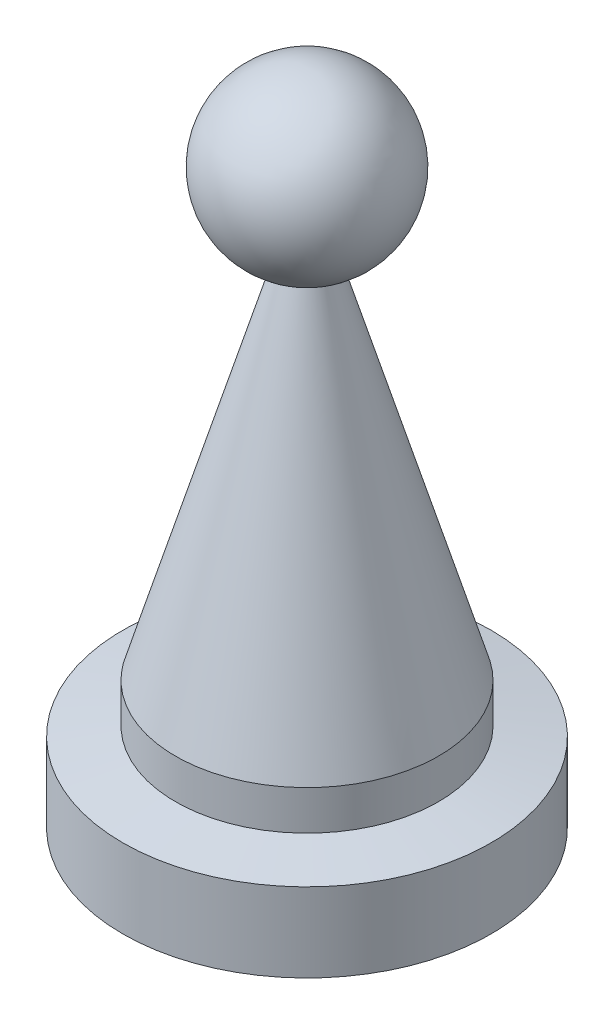
ISO-10303-21;
HEADER;
FILE_DESCRIPTION(('STEP AP214'),'2;1');
FILE_NAME('part.step','',(''),(''),'','','');
FILE_SCHEMA(('AUTOMOTIVE_DESIGN { 1 0 10303 214 1 1 1 1 }'));
ENDSEC;
DATA;
#1=APPLICATION_CONTEXT('core data for automotive mechanical design processes');
#2=APPLICATION_PROTOCOL_DEFINITION('international standard','automotive_design',2000,#1);
#3=PRODUCT_CONTEXT('',#1,'mechanical');
#4=PRODUCT('Part','Part','',(#3));
#5=PRODUCT_RELATED_PRODUCT_CATEGORY('part','',(#4));
#6=PRODUCT_DEFINITION_FORMATION('','',#4);
#7=PRODUCT_DEFINITION_CONTEXT('part definition',#1,'design');
#8=PRODUCT_DEFINITION('design','',#6,#7);
#9=PRODUCT_DEFINITION_SHAPE('','',#8);
#10=(LENGTH_UNIT() NAMED_UNIT(*) SI_UNIT(.MILLI.,.METRE.));
#11=(NAMED_UNIT(*) PLANE_ANGLE_UNIT() SI_UNIT($,.RADIAN.));
#12=(NAMED_UNIT(*) SI_UNIT($,.STERADIAN.) SOLID_ANGLE_UNIT());
#13=UNCERTAINTY_MEASURE_WITH_UNIT(LENGTH_MEASURE(1.E-05),#10,'distance_accuracy_value','');
#14=(GEOMETRIC_REPRESENTATION_CONTEXT(3) GLOBAL_UNCERTAINTY_ASSIGNED_CONTEXT((#13)) GLOBAL_UNIT_ASSIGNED_CONTEXT((#10,
#11,#12)) REPRESENTATION_CONTEXT('',''));
#15=CARTESIAN_POINT('',(0.,0.,0.));
#16=DIRECTION('',(0.,0.,1.));
#17=DIRECTION('',(1.,0.,0.));
#18=AXIS2_PLACEMENT_3D('',#15,#16,#17);
#19=CARTESIAN_POINT('',(0.,0.,0.));
#20=DIRECTION('',(0.,-1.,0.));
#21=DIRECTION('',(0.,0.,-1.));
#22=AXIS2_PLACEMENT_3D('',#19,#20,#21);
#23=PLANE('',#22);
#24=CARTESIAN_POINT('',(0.,0.,0.));
#25=DIRECTION('',(0.,-1.,0.));
#26=DIRECTION('',(0.,0.,-1.));
#27=AXIS2_PLACEMENT_3D('',#24,#25,#26);
#28=CIRCLE('',#27,7.);
#29=CARTESIAN_POINT('',(0.,0.,-7.));
#30=VERTEX_POINT('',#29);
#31=EDGE_CURVE('E10',#30,#30,#28,.T.);
#32=ORIENTED_EDGE('',*,*,#31,.T.);
#33=EDGE_LOOP('',(#32));
#34=FACE_BOUND('',#33,.T.);
#35=ADVANCED_FACE('F31',(#34),#23,.T.);
#36=CARTESIAN_POINT('',(0.,0.,0.));
#37=DIRECTION('',(0.,-1.,0.));
#38=DIRECTION('',(0.,0.,-1.));
#39=AXIS2_PLACEMENT_3D('',#36,#37,#38);
#40=CYLINDRICAL_SURFACE('',#39,7.);
#41=CARTESIAN_POINT('',(0.,3.,0.));
#42=DIRECTION('',(0.,-1.,0.));
#43=DIRECTION('',(0.,0.,-1.));
#44=AXIS2_PLACEMENT_3D('',#41,#42,#43);
#45=CIRCLE('',#44,7.);
#46=CARTESIAN_POINT('',(0.,3.,-7.));
#47=VERTEX_POINT('',#46);
#48=EDGE_CURVE('E37',#47,#47,#45,.T.);
#49=ORIENTED_EDGE('',*,*,#48,.T.);
#50=EDGE_LOOP('',(#49));
#51=FACE_BOUND('',#50,.T.);
#52=ORIENTED_EDGE('',*,*,#31,.F.);
#53=EDGE_LOOP('',(#52));
#54=FACE_BOUND('',#53,.T.);
#55=ADVANCED_FACE('F66',(#51,#54),#40,.T.);
#56=CARTESIAN_POINT('',(0.,3.,0.));
#57=DIRECTION('',(0.,-1.,0.));
#58=DIRECTION('',(0.,0.,-1.));
#59=AXIS2_PLACEMENT_3D('',#56,#57,#58);
#60=CONICAL_SURFACE('',#59,7.,1.39626340159547);
#61=CARTESIAN_POINT('',(0.,3.35265396141692,0.));
#62=DIRECTION('',(0.,-1.,0.));
#63=DIRECTION('',(0.,0.,-1.));
#64=AXIS2_PLACEMENT_3D('',#61,#62,#63);
#65=CIRCLE('',#64,5.);
#66=CARTESIAN_POINT('',(0.,3.35265396141692,-5.));
#67=VERTEX_POINT('',#66);
#68=EDGE_CURVE('E41',#67,#67,#65,.T.);
#69=ORIENTED_EDGE('',*,*,#68,.T.);
#70=EDGE_LOOP('',(#69));
#71=FACE_BOUND('',#70,.T.);
#72=ORIENTED_EDGE('',*,*,#48,.F.);
#73=EDGE_LOOP('',(#72));
#74=FACE_BOUND('',#73,.T.);
#75=ADVANCED_FACE('F70',(#71,#74),#60,.T.);
#76=CARTESIAN_POINT('',(0.,0.,0.));
#77=DIRECTION('',(0.,-1.,0.));
#78=DIRECTION('',(0.,0.,-1.));
#79=AXIS2_PLACEMENT_3D('',#76,#77,#78);
#80=CYLINDRICAL_SURFACE('',#79,5.);
#81=CARTESIAN_POINT('',(0.,4.85265396141692,0.));
#82=DIRECTION('',(0.,-1.,0.));
#83=DIRECTION('',(0.,0.,-1.));
#84=AXIS2_PLACEMENT_3D('',#81,#82,#83);
#85=CIRCLE('',#84,5.);
#86=CARTESIAN_POINT('',(0.,4.85265396141692,-5.));
#87=VERTEX_POINT('',#86);
#88=EDGE_CURVE('E45',#87,#87,#85,.T.);
#89=ORIENTED_EDGE('',*,*,#88,.T.);
#90=EDGE_LOOP('',(#89));
#91=FACE_BOUND('',#90,.T.);
#92=ORIENTED_EDGE('',*,*,#68,.F.);
#93=EDGE_LOOP('',(#92));
#94=FACE_BOUND('',#93,.T.);
#95=ADVANCED_FACE('F63',(#91,#94),#80,.T.);
#96=CARTESIAN_POINT('',(0.,4.85265396141692,0.));
#97=DIRECTION('',(0.,-1.,0.));
#98=DIRECTION('',(0.,0.,-1.));
#99=AXIS2_PLACEMENT_3D('',#96,#97,#98);
#100=CONICAL_SURFACE('',#99,5.,0.28769519293891);
#101=CARTESIAN_POINT('',(0.,18.6335737179492,0.));
#102=DIRECTION('',(0.,-1.,0.));
#103=DIRECTION('',(0.,0.,-1.));
#104=AXIS2_PLACEMENT_3D('',#101,#102,#103);
#105=CIRCLE('',#104,0.922164425979924);
#106=CARTESIAN_POINT('',(0.,18.6335737179492,-0.922164425979924));
#107=VERTEX_POINT('',#106);
#108=EDGE_CURVE('E50',#107,#107,#105,.T.);
#109=ORIENTED_EDGE('',*,*,#108,.T.);
#110=EDGE_LOOP('',(#109));
#111=FACE_BOUND('',#110,.T.);
#112=ORIENTED_EDGE('',*,*,#88,.F.);
#113=EDGE_LOOP('',(#112));
#114=FACE_BOUND('',#113,.T.);
#115=ADVANCED_FACE('F54',(#111,#114),#100,.T.);
#116=CARTESIAN_POINT('',(0.,21.75,0.));
#117=DIRECTION('',(0.,-1.,0.));
#118=DIRECTION('',(1.,0.,0.));
#119=AXIS2_PLACEMENT_3D('',#116,#117,#118);
#120=SPHERICAL_SURFACE('',#119,3.25);
#121=ORIENTED_EDGE('',*,*,#108,.F.);
#122=EDGE_LOOP('',(#121));
#123=FACE_BOUND('',#122,.T.);
#124=ADVANCED_FACE('F57',(#123),#120,.T.);
#125=CLOSED_SHELL('',(#35,#55,#75,#95,#115,#124));
#126=MANIFOLD_SOLID_BREP('B2',#125);
#127=ADVANCED_BREP_SHAPE_REPRESENTATION('',(#18,#126),#14);
#128=SHAPE_DEFINITION_REPRESENTATION(#9,#127);
ENDSEC;
END-ISO-10303-21;
